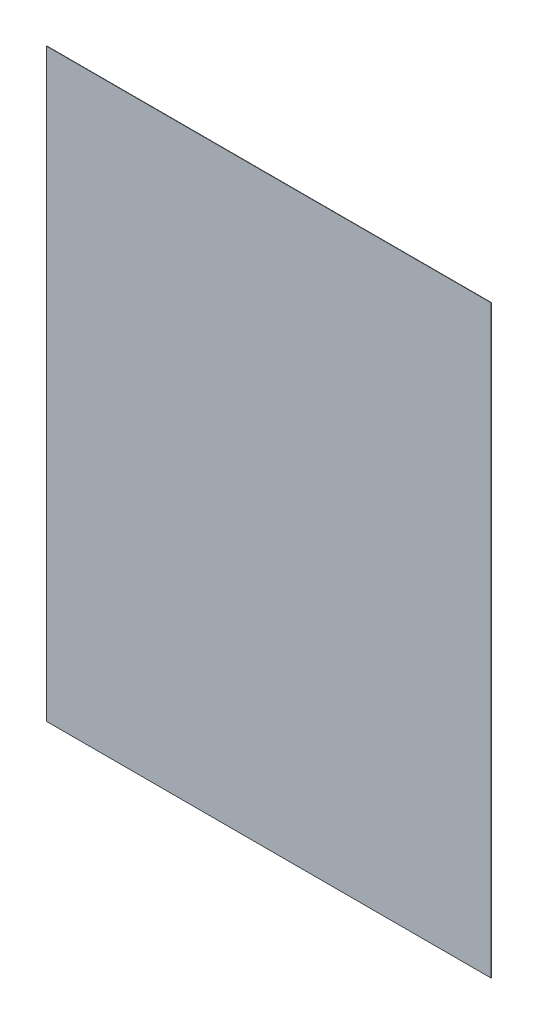
ISO-10303-21;
HEADER;
FILE_DESCRIPTION(('STEP AP214'),'2;1');
FILE_NAME('part.step','',(''),(''),'','','');
FILE_SCHEMA(('AUTOMOTIVE_DESIGN { 1 0 10303 214 1 1 1 1 }'));
ENDSEC;
DATA;
#1=APPLICATION_CONTEXT('core data for automotive mechanical design processes');
#2=APPLICATION_PROTOCOL_DEFINITION('international standard','automotive_design',2000,#1);
#3=PRODUCT_CONTEXT('',#1,'mechanical');
#4=PRODUCT('Part','Part','',(#3));
#5=PRODUCT_RELATED_PRODUCT_CATEGORY('part','',(#4));
#6=PRODUCT_DEFINITION_FORMATION('','',#4);
#7=PRODUCT_DEFINITION_CONTEXT('part definition',#1,'design');
#8=PRODUCT_DEFINITION('design','',#6,#7);
#9=PRODUCT_DEFINITION_SHAPE('','',#8);
#10=(LENGTH_UNIT() NAMED_UNIT(*) SI_UNIT(.MILLI.,.METRE.));
#11=(NAMED_UNIT(*) PLANE_ANGLE_UNIT() SI_UNIT($,.RADIAN.));
#12=(NAMED_UNIT(*) SI_UNIT($,.STERADIAN.) SOLID_ANGLE_UNIT());
#13=UNCERTAINTY_MEASURE_WITH_UNIT(LENGTH_MEASURE(1.E-05),#10,'distance_accuracy_value','');
#14=(GEOMETRIC_REPRESENTATION_CONTEXT(3) GLOBAL_UNCERTAINTY_ASSIGNED_CONTEXT((#13)) GLOBAL_UNIT_ASSIGNED_CONTEXT((#10,
#11,#12)) REPRESENTATION_CONTEXT('',''));
#15=CARTESIAN_POINT('',(0.,0.,0.));
#16=DIRECTION('',(0.,0.,1.));
#17=DIRECTION('',(1.,0.,0.));
#18=AXIS2_PLACEMENT_3D('',#15,#16,#17);
#19=CARTESIAN_POINT('',(78.05,102.75,0.1159));
#20=DIRECTION('',(-1.,0.,0.));
#21=DIRECTION('',(0.,-1.,0.));
#22=AXIS2_PLACEMENT_3D('',#19,#20,#21);
#23=PLANE('',#22);
#24=DIRECTION('',(0.,1.,0.));
#25=VECTOR('',#24,1.);
#26=CARTESIAN_POINT('',(78.05,102.75,0.));
#27=LINE('',#26,#25);
#28=CARTESIAN_POINT('',(78.05,-102.75,0.));
#29=VERTEX_POINT('',#28);
#30=CARTESIAN_POINT('',(78.05,102.75,0.));
#31=VERTEX_POINT('',#30);
#32=EDGE_CURVE('E99',#29,#31,#27,.T.);
#33=ORIENTED_EDGE('',*,*,#32,.T.);
#34=DIRECTION('',(0.,0.,-1.));
#35=VECTOR('',#34,1.);
#36=CARTESIAN_POINT('',(78.05,102.75,0.1159));
#37=LINE('',#36,#35);
#38=CARTESIAN_POINT('',(78.05,102.75,0.1159));
#39=VERTEX_POINT('',#38);
#40=EDGE_CURVE('E11',#39,#31,#37,.T.);
#41=ORIENTED_EDGE('',*,*,#40,.F.);
#42=DIRECTION('',(0.,1.,0.));
#43=VECTOR('',#42,1.);
#44=CARTESIAN_POINT('',(78.05,102.75,0.1159));
#45=LINE('',#44,#43);
#46=CARTESIAN_POINT('',(78.05,-102.75,0.1159));
#47=VERTEX_POINT('',#46);
#48=EDGE_CURVE('E87',#47,#39,#45,.T.);
#49=ORIENTED_EDGE('',*,*,#48,.F.);
#50=DIRECTION('',(0.,0.,-1.));
#51=VECTOR('',#50,1.);
#52=CARTESIAN_POINT('',(78.05,-102.75,0.1159));
#53=LINE('',#52,#51);
#54=EDGE_CURVE('E95',#47,#29,#53,.T.);
#55=ORIENTED_EDGE('',*,*,#54,.T.);
#56=EDGE_LOOP('',(#33,#41,#49,#55));
#57=FACE_BOUND('',#56,.T.);
#58=ADVANCED_FACE('F36',(#57),#23,.F.);
#59=CARTESIAN_POINT('',(-78.05,102.75,0.1159));
#60=DIRECTION('',(0.,-1.,0.));
#61=DIRECTION('',(0.,0.,-1.));
#62=AXIS2_PLACEMENT_3D('',#59,#60,#61);
#63=PLANE('',#62);
#64=DIRECTION('',(-1.,0.,0.));
#65=VECTOR('',#64,1.);
#66=CARTESIAN_POINT('',(-78.05,102.75,0.));
#67=LINE('',#66,#65);
#68=CARTESIAN_POINT('',(-78.05,102.75,0.));
#69=VERTEX_POINT('',#68);
#70=EDGE_CURVE('E91',#31,#69,#67,.T.);
#71=ORIENTED_EDGE('',*,*,#70,.T.);
#72=DIRECTION('',(0.,0.,-1.));
#73=VECTOR('',#72,1.);
#74=CARTESIAN_POINT('',(-78.05,102.75,0.1159));
#75=LINE('',#74,#73);
#76=CARTESIAN_POINT('',(-78.05,102.75,0.1159));
#77=VERTEX_POINT('',#76);
#78=EDGE_CURVE('E44',#77,#69,#75,.T.);
#79=ORIENTED_EDGE('',*,*,#78,.F.);
#80=DIRECTION('',(-1.,0.,0.));
#81=VECTOR('',#80,1.);
#82=CARTESIAN_POINT('',(-78.05,102.75,0.1159));
#83=LINE('',#82,#81);
#84=EDGE_CURVE('E82',#39,#77,#83,.T.);
#85=ORIENTED_EDGE('',*,*,#84,.F.);
#86=ORIENTED_EDGE('',*,*,#40,.T.);
#87=EDGE_LOOP('',(#71,#79,#85,#86));
#88=FACE_BOUND('',#87,.T.);
#89=ADVANCED_FACE('F90',(#88),#63,.F.);
#90=CARTESIAN_POINT('',(-78.05,102.75,0.1159));
#91=DIRECTION('',(1.,0.,0.));
#92=DIRECTION('',(0.,1.,0.));
#93=AXIS2_PLACEMENT_3D('',#90,#91,#92);
#94=PLANE('',#93);
#95=DIRECTION('',(0.,-1.,0.));
#96=VECTOR('',#95,1.);
#97=CARTESIAN_POINT('',(-78.05,102.75,0.));
#98=LINE('',#97,#96);
#99=CARTESIAN_POINT('',(-78.05,-102.75,0.));
#100=VERTEX_POINT('',#99);
#101=EDGE_CURVE('E69',#69,#100,#98,.T.);
#102=ORIENTED_EDGE('',*,*,#101,.T.);
#103=DIRECTION('',(0.,0.,-1.));
#104=VECTOR('',#103,1.);
#105=CARTESIAN_POINT('',(-78.05,-102.75,0.1159));
#106=LINE('',#105,#104);
#107=CARTESIAN_POINT('',(-78.05,-102.75,0.1159));
#108=VERTEX_POINT('',#107);
#109=EDGE_CURVE('E92',#108,#100,#106,.T.);
#110=ORIENTED_EDGE('',*,*,#109,.F.);
#111=DIRECTION('',(0.,-1.,0.));
#112=VECTOR('',#111,1.);
#113=CARTESIAN_POINT('',(-78.05,102.75,0.1159));
#114=LINE('',#113,#112);
#115=EDGE_CURVE('E85',#77,#108,#114,.T.);
#116=ORIENTED_EDGE('',*,*,#115,.F.);
#117=ORIENTED_EDGE('',*,*,#78,.T.);
#118=EDGE_LOOP('',(#102,#110,#116,#117));
#119=FACE_BOUND('',#118,.T.);
#120=ADVANCED_FACE('F93',(#119),#94,.F.);
#121=CARTESIAN_POINT('',(-78.05,-102.75,0.1159));
#122=DIRECTION('',(0.,1.,0.));
#123=DIRECTION('',(0.,0.,1.));
#124=AXIS2_PLACEMENT_3D('',#121,#122,#123);
#125=PLANE('',#124);
#126=DIRECTION('',(1.,0.,0.));
#127=VECTOR('',#126,1.);
#128=CARTESIAN_POINT('',(-78.05,-102.75,0.));
#129=LINE('',#128,#127);
#130=EDGE_CURVE('E75',#100,#29,#129,.T.);
#131=ORIENTED_EDGE('',*,*,#130,.T.);
#132=ORIENTED_EDGE('',*,*,#54,.F.);
#133=DIRECTION('',(1.,0.,0.));
#134=VECTOR('',#133,1.);
#135=CARTESIAN_POINT('',(-78.05,-102.75,0.1159));
#136=LINE('',#135,#134);
#137=EDGE_CURVE('E52',#108,#47,#136,.T.);
#138=ORIENTED_EDGE('',*,*,#137,.F.);
#139=ORIENTED_EDGE('',*,*,#109,.T.);
#140=EDGE_LOOP('',(#131,#132,#138,#139));
#141=FACE_BOUND('',#140,.T.);
#142=ADVANCED_FACE('F106',(#141),#125,.F.);
#143=CARTESIAN_POINT('',(0.,0.,0.1159));
#144=DIRECTION('',(0.,0.,1.));
#145=DIRECTION('',(1.,0.,0.));
#146=AXIS2_PLACEMENT_3D('',#143,#144,#145);
#147=PLANE('',#146);
#148=ORIENTED_EDGE('',*,*,#48,.T.);
#149=ORIENTED_EDGE('',*,*,#84,.T.);
#150=ORIENTED_EDGE('',*,*,#115,.T.);
#151=ORIENTED_EDGE('',*,*,#137,.T.);
#152=EDGE_LOOP('',(#148,#149,#150,#151));
#153=FACE_BOUND('',#152,.T.);
#154=ADVANCED_FACE('F83',(#153),#147,.T.);
#155=CARTESIAN_POINT('',(0.,0.,0.));
#156=DIRECTION('',(0.,0.,1.));
#157=DIRECTION('',(1.,0.,0.));
#158=AXIS2_PLACEMENT_3D('',#155,#156,#157);
#159=PLANE('',#158);
#160=ORIENTED_EDGE('',*,*,#32,.F.);
#161=ORIENTED_EDGE('',*,*,#130,.F.);
#162=ORIENTED_EDGE('',*,*,#101,.F.);
#163=ORIENTED_EDGE('',*,*,#70,.F.);
#164=EDGE_LOOP('',(#160,#161,#162,#163));
#165=FACE_BOUND('',#164,.T.);
#166=ADVANCED_FACE('F109',(#165),#159,.F.);
#167=CLOSED_SHELL('',(#58,#89,#120,#142,#154,#166));
#168=MANIFOLD_SOLID_BREP('B2',#167);
#169=ADVANCED_BREP_SHAPE_REPRESENTATION('',(#18,#168),#14);
#170=SHAPE_DEFINITION_REPRESENTATION(#9,#169);
ENDSEC;
END-ISO-10303-21;
